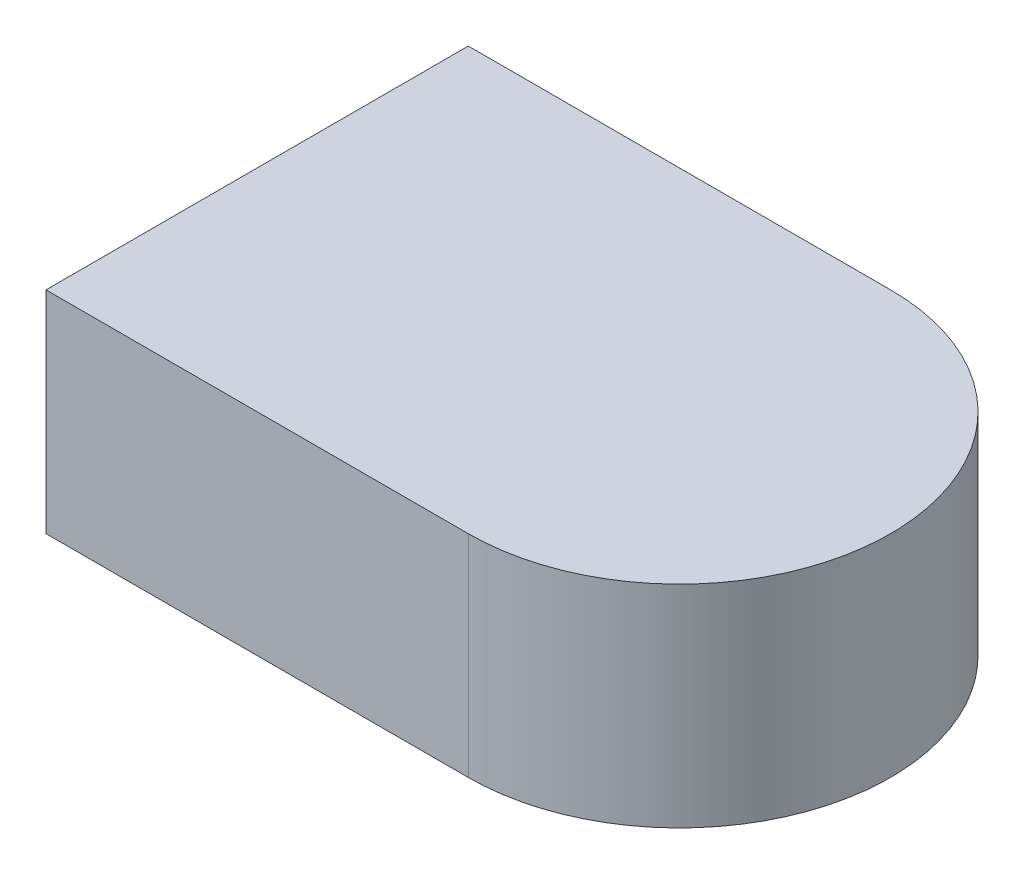
ISO-10303-21;
HEADER;
FILE_DESCRIPTION(('STEP AP214'),'2;1');
FILE_NAME('part.step','',(''),(''),'','','');
FILE_SCHEMA(('AUTOMOTIVE_DESIGN { 1 0 10303 214 1 1 1 1 }'));
ENDSEC;
DATA;
#1=APPLICATION_CONTEXT('core data for automotive mechanical design processes');
#2=APPLICATION_PROTOCOL_DEFINITION('international standard','automotive_design',2000,#1);
#3=PRODUCT_CONTEXT('',#1,'mechanical');
#4=PRODUCT('Part','Part','',(#3));
#5=PRODUCT_RELATED_PRODUCT_CATEGORY('part','',(#4));
#6=PRODUCT_DEFINITION_FORMATION('','',#4);
#7=PRODUCT_DEFINITION_CONTEXT('part definition',#1,'design');
#8=PRODUCT_DEFINITION('design','',#6,#7);
#9=PRODUCT_DEFINITION_SHAPE('','',#8);
#10=(LENGTH_UNIT() NAMED_UNIT(*) SI_UNIT(.MILLI.,.METRE.));
#11=(NAMED_UNIT(*) PLANE_ANGLE_UNIT() SI_UNIT($,.RADIAN.));
#12=(NAMED_UNIT(*) SI_UNIT($,.STERADIAN.) SOLID_ANGLE_UNIT());
#13=UNCERTAINTY_MEASURE_WITH_UNIT(LENGTH_MEASURE(1.E-05),#10,'distance_accuracy_value','');
#14=(GEOMETRIC_REPRESENTATION_CONTEXT(3) GLOBAL_UNCERTAINTY_ASSIGNED_CONTEXT((#13)) GLOBAL_UNIT_ASSIGNED_CONTEXT((#10,
#11,#12)) REPRESENTATION_CONTEXT('',''));
#15=CARTESIAN_POINT('',(0.,0.,0.));
#16=DIRECTION('',(0.,0.,1.));
#17=DIRECTION('',(1.,0.,0.));
#18=AXIS2_PLACEMENT_3D('',#15,#16,#17);
#19=CARTESIAN_POINT('',(0.,0.,0.));
#20=DIRECTION('',(0.,-1.,0.));
#21=DIRECTION('',(-1.,0.,0.));
#22=AXIS2_PLACEMENT_3D('',#19,#20,#21);
#23=PLANE('',#22);
#24=CARTESIAN_POINT('',(-1.05,0.,1.4));
#25=DIRECTION('',(0.,-1.,0.));
#26=DIRECTION('',(0.,0.,-1.));
#27=AXIS2_PLACEMENT_3D('',#24,#25,#26);
#28=CIRCLE('',#27,0.1);
#29=CARTESIAN_POINT('',(-1.05,0.,1.3));
#30=VERTEX_POINT('',#29);
#31=CARTESIAN_POINT('',(-1.05,0.,1.5));
#32=VERTEX_POINT('',#31);
#33=EDGE_CURVE('E11',#30,#32,#28,.T.);
#34=ORIENTED_EDGE('',*,*,#33,.T.);
#35=DIRECTION('',(-1.,0.,0.));
#36=VECTOR('',#35,1.);
#37=CARTESIAN_POINT('',(-1.05,0.,1.5));
#38=LINE('',#37,#36);
#39=CARTESIAN_POINT('',(-1.25,0.,1.5));
#40=VERTEX_POINT('',#39);
#41=EDGE_CURVE('E25',#32,#40,#38,.T.);
#42=ORIENTED_EDGE('',*,*,#41,.T.);
#43=DIRECTION('',(0.,0.,-1.));
#44=VECTOR('',#43,1.);
#45=CARTESIAN_POINT('',(-1.25,0.,1.5));
#46=LINE('',#45,#44);
#47=CARTESIAN_POINT('',(-1.25,0.,1.3));
#48=VERTEX_POINT('',#47);
#49=EDGE_CURVE('E73',#40,#48,#46,.T.);
#50=ORIENTED_EDGE('',*,*,#49,.T.);
#51=DIRECTION('',(1.,0.,0.));
#52=VECTOR('',#51,1.);
#53=CARTESIAN_POINT('',(-1.25,0.,1.3));
#54=LINE('',#53,#52);
#55=EDGE_CURVE('E99',#48,#30,#54,.T.);
#56=ORIENTED_EDGE('',*,*,#55,.T.);
#57=EDGE_LOOP('',(#34,#42,#50,#56));
#58=FACE_BOUND('',#57,.T.);
#59=ADVANCED_FACE('F17',(#58),#23,.T.);
#60=CARTESIAN_POINT('',(-1.25,0.,1.3));
#61=DIRECTION('',(0.,0.,1.));
#62=DIRECTION('',(1.,0.,0.));
#63=AXIS2_PLACEMENT_3D('',#60,#61,#62);
#64=PLANE('',#63);
#65=DIRECTION('',(0.,1.,0.));
#66=VECTOR('',#65,1.);
#67=CARTESIAN_POINT('',(-1.25,0.,1.3));
#68=LINE('',#67,#66);
#69=CARTESIAN_POINT('',(-1.25,0.1,1.3));
#70=VERTEX_POINT('',#69);
#71=EDGE_CURVE('E95',#48,#70,#68,.T.);
#72=ORIENTED_EDGE('',*,*,#71,.T.);
#73=DIRECTION('',(1.,0.,0.));
#74=VECTOR('',#73,1.);
#75=CARTESIAN_POINT('',(-1.25,0.1,1.3));
#76=LINE('',#75,#74);
#77=CARTESIAN_POINT('',(-1.05,0.1,1.3));
#78=VERTEX_POINT('',#77);
#79=EDGE_CURVE('E68',#70,#78,#76,.T.);
#80=ORIENTED_EDGE('',*,*,#79,.T.);
#81=DIRECTION('',(0.,1.,0.));
#82=VECTOR('',#81,1.);
#83=CARTESIAN_POINT('',(-1.05,0.,1.3));
#84=LINE('',#83,#82);
#85=EDGE_CURVE('E87',#30,#78,#84,.T.);
#86=ORIENTED_EDGE('',*,*,#85,.F.);
#87=ORIENTED_EDGE('',*,*,#55,.F.);
#88=EDGE_LOOP('',(#72,#80,#86,#87));
#89=FACE_BOUND('',#88,.T.);
#90=ADVANCED_FACE('F113',(#89),#64,.F.);
#91=CARTESIAN_POINT('',(-1.05,0.,1.4));
#92=DIRECTION('',(0.,-1.,0.));
#93=DIRECTION('',(-1.,0.,0.));
#94=AXIS2_PLACEMENT_3D('',#91,#92,#93);
#95=CYLINDRICAL_SURFACE('',#94,0.1);
#96=ORIENTED_EDGE('',*,*,#85,.T.);
#97=CARTESIAN_POINT('',(-1.05,0.1,1.4));
#98=DIRECTION('',(0.,-1.,0.));
#99=DIRECTION('',(0.,0.,-1.));
#100=AXIS2_PLACEMENT_3D('',#97,#98,#99);
#101=CIRCLE('',#100,0.1);
#102=CARTESIAN_POINT('',(-1.05,0.1,1.5));
#103=VERTEX_POINT('',#102);
#104=EDGE_CURVE('E83',#78,#103,#101,.T.);
#105=ORIENTED_EDGE('',*,*,#104,.T.);
#106=DIRECTION('',(0.,1.,0.));
#107=VECTOR('',#106,1.);
#108=CARTESIAN_POINT('',(-1.05,0.,1.5));
#109=LINE('',#108,#107);
#110=EDGE_CURVE('E60',#32,#103,#109,.T.);
#111=ORIENTED_EDGE('',*,*,#110,.F.);
#112=ORIENTED_EDGE('',*,*,#33,.F.);
#113=EDGE_LOOP('',(#96,#105,#111,#112));
#114=FACE_BOUND('',#113,.T.);
#115=ADVANCED_FACE('F115',(#114),#95,.T.);
#116=CARTESIAN_POINT('',(-1.05,0.,1.5));
#117=DIRECTION('',(0.,0.,-1.));
#118=DIRECTION('',(-1.,0.,0.));
#119=AXIS2_PLACEMENT_3D('',#116,#117,#118);
#120=PLANE('',#119);
#121=ORIENTED_EDGE('',*,*,#110,.T.);
#122=DIRECTION('',(-1.,0.,0.));
#123=VECTOR('',#122,1.);
#124=CARTESIAN_POINT('',(-1.05,0.1,1.5));
#125=LINE('',#124,#123);
#126=CARTESIAN_POINT('',(-1.25,0.1,1.5));
#127=VERTEX_POINT('',#126);
#128=EDGE_CURVE('E53',#103,#127,#125,.T.);
#129=ORIENTED_EDGE('',*,*,#128,.T.);
#130=DIRECTION('',(0.,1.,0.));
#131=VECTOR('',#130,1.);
#132=CARTESIAN_POINT('',(-1.25,0.,1.5));
#133=LINE('',#132,#131);
#134=EDGE_CURVE('E57',#40,#127,#133,.T.);
#135=ORIENTED_EDGE('',*,*,#134,.F.);
#136=ORIENTED_EDGE('',*,*,#41,.F.);
#137=EDGE_LOOP('',(#121,#129,#135,#136));
#138=FACE_BOUND('',#137,.T.);
#139=ADVANCED_FACE('F55',(#138),#120,.F.);
#140=CARTESIAN_POINT('',(-1.25,0.,1.5));
#141=DIRECTION('',(1.,0.,0.));
#142=DIRECTION('',(0.,0.,-1.));
#143=AXIS2_PLACEMENT_3D('',#140,#141,#142);
#144=PLANE('',#143);
#145=ORIENTED_EDGE('',*,*,#134,.T.);
#146=DIRECTION('',(0.,0.,-1.));
#147=VECTOR('',#146,1.);
#148=CARTESIAN_POINT('',(-1.25,0.1,1.5));
#149=LINE('',#148,#147);
#150=EDGE_CURVE('E66',#127,#70,#149,.T.);
#151=ORIENTED_EDGE('',*,*,#150,.T.);
#152=ORIENTED_EDGE('',*,*,#71,.F.);
#153=ORIENTED_EDGE('',*,*,#49,.F.);
#154=EDGE_LOOP('',(#145,#151,#152,#153));
#155=FACE_BOUND('',#154,.T.);
#156=ADVANCED_FACE('F72',(#155),#144,.F.);
#157=CARTESIAN_POINT('',(0.,0.1,0.));
#158=DIRECTION('',(0.,-1.,0.));
#159=DIRECTION('',(-1.,0.,0.));
#160=AXIS2_PLACEMENT_3D('',#157,#158,#159);
#161=PLANE('',#160);
#162=ORIENTED_EDGE('',*,*,#150,.F.);
#163=ORIENTED_EDGE('',*,*,#128,.F.);
#164=ORIENTED_EDGE('',*,*,#104,.F.);
#165=ORIENTED_EDGE('',*,*,#79,.F.);
#166=EDGE_LOOP('',(#162,#163,#164,#165));
#167=FACE_BOUND('',#166,.T.);
#168=ADVANCED_FACE('F67',(#167),#161,.F.);
#169=CLOSED_SHELL('',(#59,#90,#115,#139,#156,#168));
#170=MANIFOLD_SOLID_BREP('B1',#169);
#171=ADVANCED_BREP_SHAPE_REPRESENTATION('',(#18,#170),#14);
#172=SHAPE_DEFINITION_REPRESENTATION(#9,#171);
ENDSEC;
END-ISO-10303-21;
